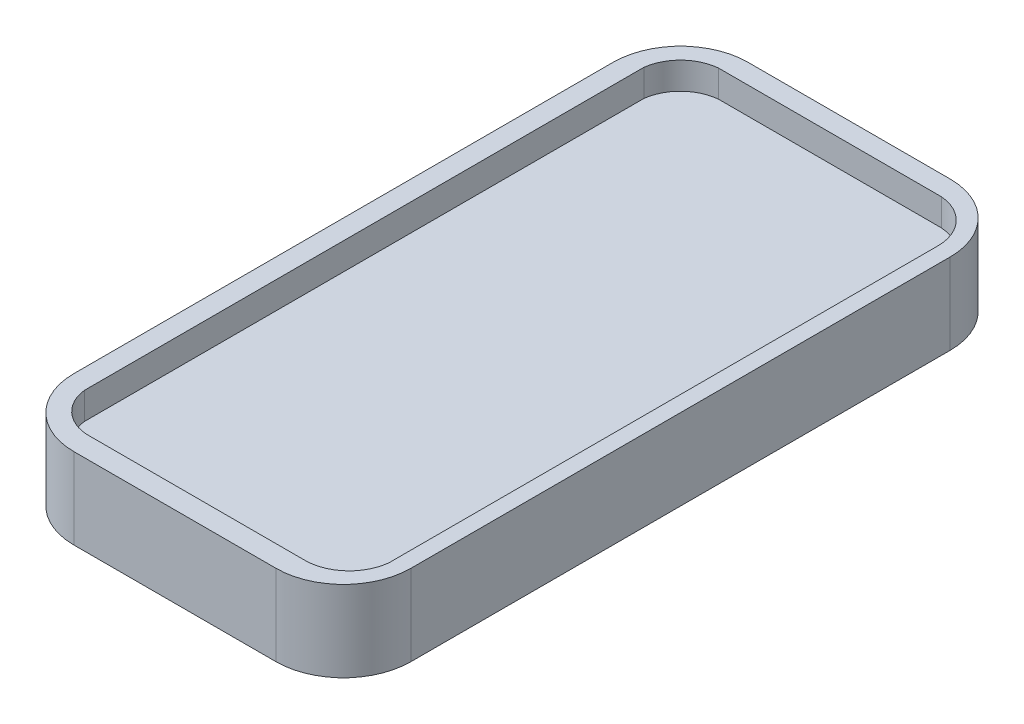
ISO-10303-21;
HEADER;
FILE_DESCRIPTION(('STEP AP214'),'2;1');
FILE_NAME('part.step','',(''),(''),'','','');
FILE_SCHEMA(('AUTOMOTIVE_DESIGN { 1 0 10303 214 1 1 1 1 }'));
ENDSEC;
DATA;
#1=APPLICATION_CONTEXT('core data for automotive mechanical design processes');
#2=APPLICATION_PROTOCOL_DEFINITION('international standard','automotive_design',2000,#1);
#3=PRODUCT_CONTEXT('',#1,'mechanical');
#4=PRODUCT('Part','Part','',(#3));
#5=PRODUCT_RELATED_PRODUCT_CATEGORY('part','',(#4));
#6=PRODUCT_DEFINITION_FORMATION('','',#4);
#7=PRODUCT_DEFINITION_CONTEXT('part definition',#1,'design');
#8=PRODUCT_DEFINITION('design','',#6,#7);
#9=PRODUCT_DEFINITION_SHAPE('','',#8);
#10=(LENGTH_UNIT() NAMED_UNIT(*) SI_UNIT(.MILLI.,.METRE.));
#11=(NAMED_UNIT(*) PLANE_ANGLE_UNIT() SI_UNIT($,.RADIAN.));
#12=(NAMED_UNIT(*) SI_UNIT($,.STERADIAN.) SOLID_ANGLE_UNIT());
#13=UNCERTAINTY_MEASURE_WITH_UNIT(LENGTH_MEASURE(1.E-05),#10,'distance_accuracy_value','');
#14=(GEOMETRIC_REPRESENTATION_CONTEXT(3) GLOBAL_UNCERTAINTY_ASSIGNED_CONTEXT((#13)) GLOBAL_UNIT_ASSIGNED_CONTEXT((#10,
#11,#12)) REPRESENTATION_CONTEXT('',''));
#15=CARTESIAN_POINT('',(0.,0.,0.));
#16=DIRECTION('',(0.,0.,1.));
#17=DIRECTION('',(1.,0.,0.));
#18=AXIS2_PLACEMENT_3D('',#15,#16,#17);
#19=CARTESIAN_POINT('',(-7.78045965694231,120.,-951.577872826817));
#20=DIRECTION('',(1.,0.,0.));
#21=DIRECTION('',(0.,0.,-1.));
#22=AXIS2_PLACEMENT_3D('',#19,#20,#21);
#23=PLANE('',#22);
#24=DIRECTION('',(0.,0.,1.));
#25=VECTOR('',#24,1.);
#26=CARTESIAN_POINT('',(-7.78045965694231,120.,-951.577872826817));
#27=LINE('',#26,#25);
#28=CARTESIAN_POINT('',(-7.78045965694229,120.,-851.577872826817));
#29=VERTEX_POINT('',#28);
#30=CARTESIAN_POINT('',(-7.7804596569422,120.,-51.5778728268174));
#31=VERTEX_POINT('',#30);
#32=EDGE_CURVE('E220',#29,#31,#27,.T.);
#33=ORIENTED_EDGE('',*,*,#32,.F.);
#34=DIRECTION('',(0.,-1.,0.));
#35=VECTOR('',#34,1.);
#36=CARTESIAN_POINT('',(-7.78045965694229,120.,-851.577872826817));
#37=LINE('',#36,#35);
#38=CARTESIAN_POINT('',(-7.78045965694229,0.,-851.577872826817));
#39=VERTEX_POINT('',#38);
#40=EDGE_CURVE('E243',#29,#39,#37,.T.);
#41=ORIENTED_EDGE('',*,*,#40,.T.);
#42=DIRECTION('',(0.,0.,1.));
#43=VECTOR('',#42,1.);
#44=CARTESIAN_POINT('',(-7.78045965694231,0.,-951.577872826817));
#45=LINE('',#44,#43);
#46=CARTESIAN_POINT('',(-7.7804596569422,0.,-51.5778728268174));
#47=VERTEX_POINT('',#46);
#48=EDGE_CURVE('E208',#39,#47,#45,.T.);
#49=ORIENTED_EDGE('',*,*,#48,.T.);
#50=DIRECTION('',(0.,-1.,0.));
#51=VECTOR('',#50,1.);
#52=CARTESIAN_POINT('',(-7.7804596569422,120.,-51.5778728268174));
#53=LINE('',#52,#51);
#54=EDGE_CURVE('E232',#47,#31,#53,.F.);
#55=ORIENTED_EDGE('',*,*,#54,.T.);
#56=EDGE_LOOP('',(#33,#41,#49,#55));
#57=FACE_BOUND('',#56,.T.);
#58=ADVANCED_FACE('F34',(#57),#23,.F.);
#59=CARTESIAN_POINT('',(-7.78045965694218,120.,48.4221271731826));
#60=DIRECTION('',(0.,0.,-1.));
#61=DIRECTION('',(-1.,0.,0.));
#62=AXIS2_PLACEMENT_3D('',#59,#60,#61);
#63=PLANE('',#62);
#64=DIRECTION('',(1.,0.,0.));
#65=VECTOR('',#64,1.);
#66=CARTESIAN_POINT('',(-7.78045965694218,120.,48.4221271731826));
#67=LINE('',#66,#65);
#68=CARTESIAN_POINT('',(92.2195403430578,120.,48.4221271731826));
#69=VERTEX_POINT('',#68);
#70=CARTESIAN_POINT('',(392.219540343058,120.,48.4221271731826));
#71=VERTEX_POINT('',#70);
#72=EDGE_CURVE('E223',#69,#71,#67,.T.);
#73=ORIENTED_EDGE('',*,*,#72,.F.);
#74=DIRECTION('',(0.,-1.,0.));
#75=VECTOR('',#74,1.);
#76=CARTESIAN_POINT('',(92.2195403430578,120.,48.4221271731826));
#77=LINE('',#76,#75);
#78=CARTESIAN_POINT('',(92.2195403430578,0.,48.4221271731826));
#79=VERTEX_POINT('',#78);
#80=EDGE_CURVE('E12',#69,#79,#77,.T.);
#81=ORIENTED_EDGE('',*,*,#80,.T.);
#82=DIRECTION('',(1.,0.,0.));
#83=VECTOR('',#82,1.);
#84=CARTESIAN_POINT('',(-7.78045965694218,0.,48.4221271731826));
#85=LINE('',#84,#83);
#86=CARTESIAN_POINT('',(392.219540343058,0.,48.4221271731826));
#87=VERTEX_POINT('',#86);
#88=EDGE_CURVE('E235',#79,#87,#85,.T.);
#89=ORIENTED_EDGE('',*,*,#88,.T.);
#90=DIRECTION('',(0.,-1.,0.));
#91=VECTOR('',#90,1.);
#92=CARTESIAN_POINT('',(392.219540343058,120.,48.4221271731826));
#93=LINE('',#92,#91);
#94=EDGE_CURVE('E42',#87,#71,#93,.F.);
#95=ORIENTED_EDGE('',*,*,#94,.T.);
#96=EDGE_LOOP('',(#73,#81,#89,#95));
#97=FACE_BOUND('',#96,.T.);
#98=ADVANCED_FACE('F273',(#97),#63,.F.);
#99=CARTESIAN_POINT('',(492.219540343058,120.,-951.577872826817));
#100=DIRECTION('',(-1.,0.,0.));
#101=DIRECTION('',(0.,0.,1.));
#102=AXIS2_PLACEMENT_3D('',#99,#100,#101);
#103=PLANE('',#102);
#104=DIRECTION('',(0.,0.,-1.));
#105=VECTOR('',#104,1.);
#106=CARTESIAN_POINT('',(492.219540343058,0.,-951.577872826817));
#107=LINE('',#106,#105);
#108=CARTESIAN_POINT('',(492.219540343058,0.,-51.5778728268174));
#109=VERTEX_POINT('',#108);
#110=CARTESIAN_POINT('',(492.219540343058,0.,-851.577872826817));
#111=VERTEX_POINT('',#110);
#112=EDGE_CURVE('E238',#109,#111,#107,.T.);
#113=ORIENTED_EDGE('',*,*,#112,.T.);
#114=DIRECTION('',(0.,-1.,0.));
#115=VECTOR('',#114,1.);
#116=CARTESIAN_POINT('',(492.219540343058,120.,-851.577872826817));
#117=LINE('',#116,#115);
#118=CARTESIAN_POINT('',(492.219540343058,120.,-851.577872826817));
#119=VERTEX_POINT('',#118);
#120=EDGE_CURVE('E57',#111,#119,#117,.F.);
#121=ORIENTED_EDGE('',*,*,#120,.T.);
#122=DIRECTION('',(0.,0.,-1.));
#123=VECTOR('',#122,1.);
#124=CARTESIAN_POINT('',(492.219540343058,120.,-951.577872826817));
#125=LINE('',#124,#123);
#126=CARTESIAN_POINT('',(492.219540343058,120.,-51.5778728268174));
#127=VERTEX_POINT('',#126);
#128=EDGE_CURVE('E227',#127,#119,#125,.T.);
#129=ORIENTED_EDGE('',*,*,#128,.F.);
#130=DIRECTION('',(0.,-1.,0.));
#131=VECTOR('',#130,1.);
#132=CARTESIAN_POINT('',(492.219540343058,120.,-51.5778728268174));
#133=LINE('',#132,#131);
#134=EDGE_CURVE('E267',#127,#109,#133,.T.);
#135=ORIENTED_EDGE('',*,*,#134,.T.);
#136=EDGE_LOOP('',(#113,#121,#129,#135));
#137=FACE_BOUND('',#136,.T.);
#138=ADVANCED_FACE('F283',(#137),#103,.F.);
#139=CARTESIAN_POINT('',(-7.78045965694231,120.,-951.577872826817));
#140=DIRECTION('',(0.,0.,1.));
#141=DIRECTION('',(1.,0.,0.));
#142=AXIS2_PLACEMENT_3D('',#139,#140,#141);
#143=PLANE('',#142);
#144=DIRECTION('',(-1.,0.,0.));
#145=VECTOR('',#144,1.);
#146=CARTESIAN_POINT('',(-7.78045965694231,0.,-951.577872826817));
#147=LINE('',#146,#145);
#148=CARTESIAN_POINT('',(392.219540343058,0.,-951.577872826817));
#149=VERTEX_POINT('',#148);
#150=CARTESIAN_POINT('',(92.2195403430577,0.,-951.577872826817));
#151=VERTEX_POINT('',#150);
#152=EDGE_CURVE('E224',#149,#151,#147,.T.);
#153=ORIENTED_EDGE('',*,*,#152,.T.);
#154=DIRECTION('',(0.,-1.,0.));
#155=VECTOR('',#154,1.);
#156=CARTESIAN_POINT('',(92.2195403430577,120.,-951.577872826817));
#157=LINE('',#156,#155);
#158=CARTESIAN_POINT('',(92.2195403430577,120.,-951.577872826817));
#159=VERTEX_POINT('',#158);
#160=EDGE_CURVE('E257',#151,#159,#157,.F.);
#161=ORIENTED_EDGE('',*,*,#160,.T.);
#162=DIRECTION('',(-1.,0.,0.));
#163=VECTOR('',#162,1.);
#164=CARTESIAN_POINT('',(-7.78045965694231,120.,-951.577872826817));
#165=LINE('',#164,#163);
#166=CARTESIAN_POINT('',(392.219540343058,120.,-951.577872826817));
#167=VERTEX_POINT('',#166);
#168=EDGE_CURVE('E229',#167,#159,#165,.T.);
#169=ORIENTED_EDGE('',*,*,#168,.F.);
#170=DIRECTION('',(0.,-1.,0.));
#171=VECTOR('',#170,1.);
#172=CARTESIAN_POINT('',(392.219540343058,120.,-951.577872826817));
#173=LINE('',#172,#171);
#174=EDGE_CURVE('E254',#167,#149,#173,.T.);
#175=ORIENTED_EDGE('',*,*,#174,.T.);
#176=EDGE_LOOP('',(#153,#161,#169,#175));
#177=FACE_BOUND('',#176,.T.);
#178=ADVANCED_FACE('F294',(#177),#143,.F.);
#179=CARTESIAN_POINT('',(0.,120.,0.));
#180=DIRECTION('',(0.,1.,0.));
#181=DIRECTION('',(0.,0.,1.));
#182=AXIS2_PLACEMENT_3D('',#179,#180,#181);
#183=PLANE('',#182);
#184=CARTESIAN_POINT('',(83.4549372179487,120.,-45.5551585176228));
#185=DIRECTION('',(0.,1.,0.));
#186=DIRECTION('',(0.,0.,1.));
#187=AXIS2_PLACEMENT_3D('',#184,#185,#186);
#188=CIRCLE('',#187,62.4222434877103);
#189=CARTESIAN_POINT('',(21.508862224403,120.,-37.8596874512748));
#190=VERTEX_POINT('',#189);
#191=CARTESIAN_POINT('',(79.5875440235673,120.,16.7471668957922));
#192=VERTEX_POINT('',#191);
#193=EDGE_CURVE('E49',#190,#192,#188,.T.);
#194=ORIENTED_EDGE('',*,*,#193,.F.);
#195=DIRECTION('',(0.,0.,1.));
#196=VECTOR('',#195,1.);
#197=CARTESIAN_POINT('',(21.508862224403,120.,-867.822814394367));
#198=LINE('',#197,#196);
#199=CARTESIAN_POINT('',(21.508862224403,120.,-867.822814394367));
#200=VERTEX_POINT('',#199);
#201=EDGE_CURVE('E170',#200,#190,#198,.T.);
#202=ORIENTED_EDGE('',*,*,#201,.F.);
#203=CARTESIAN_POINT('',(83.4549372179487,120.,-860.127343328019));
#204=DIRECTION('',(0.,1.,0.));
#205=DIRECTION('',(0.,0.,1.));
#206=AXIS2_PLACEMENT_3D('',#203,#204,#205);
#207=CIRCLE('',#206,62.4222434877104);
#208=CARTESIAN_POINT('',(77.752240524381,120.,-922.288550945472));
#209=VERTEX_POINT('',#208);
#210=EDGE_CURVE('E173',#209,#200,#207,.T.);
#211=ORIENTED_EDGE('',*,*,#210,.F.);
#212=DIRECTION('',(-1.,0.,0.));
#213=VECTOR('',#212,1.);
#214=CARTESIAN_POINT('',(77.752240524381,120.,-922.288550945472));
#215=LINE('',#214,#213);
#216=CARTESIAN_POINT('',(408.615788100703,120.,-922.288550945472));
#217=VERTEX_POINT('',#216);
#218=EDGE_CURVE('E201',#217,#209,#215,.T.);
#219=ORIENTED_EDGE('',*,*,#218,.F.);
#220=CARTESIAN_POINT('',(402.913091407135,120.,-856.568140193166));
#221=DIRECTION('',(0.,1.,0.));
#222=DIRECTION('',(0.,0.,1.));
#223=AXIS2_PLACEMENT_3D('',#220,#221,#222);
#224=CIRCLE('',#223,65.9673641964772);
#225=CARTESIAN_POINT('',(468.879013747041,120.,-857.00429254749));
#226=VERTEX_POINT('',#225);
#227=EDGE_CURVE('E198',#226,#217,#224,.T.);
#228=ORIENTED_EDGE('',*,*,#227,.F.);
#229=DIRECTION('',(0.,0.,-1.));
#230=VECTOR('',#229,1.);
#231=CARTESIAN_POINT('',(468.879013747041,120.,-857.00429254749));
#232=LINE('',#231,#230);
#233=CARTESIAN_POINT('',(468.879013747041,120.,-42.2181657520519));
#234=VERTEX_POINT('',#233);
#235=EDGE_CURVE('E195',#234,#226,#232,.T.);
#236=ORIENTED_EDGE('',*,*,#235,.F.);
#237=CARTESIAN_POINT('',(402.913091407135,120.,-49.5074973572647));
#238=DIRECTION('',(0.,1.,0.));
#239=DIRECTION('',(0.,0.,1.));
#240=AXIS2_PLACEMENT_3D('',#237,#238,#239);
#241=CIRCLE('',#240,66.3674413052458);
#242=CARTESIAN_POINT('',(406.780484601518,120.,16.7471668957921));
#243=VERTEX_POINT('',#242);
#244=EDGE_CURVE('E192',#243,#234,#241,.T.);
#245=ORIENTED_EDGE('',*,*,#244,.F.);
#246=DIRECTION('',(1.,0.,0.));
#247=VECTOR('',#246,1.);
#248=CARTESIAN_POINT('',(79.5875440235673,120.,16.7471668957922));
#249=LINE('',#248,#247);
#250=EDGE_CURVE('E190',#192,#243,#249,.T.);
#251=ORIENTED_EDGE('',*,*,#250,.F.);
#252=EDGE_LOOP('',(#194,#202,#211,#219,#228,#236,#245,#251));
#253=FACE_BOUND('',#252,.T.);
#254=ORIENTED_EDGE('',*,*,#168,.T.);
#255=CARTESIAN_POINT('',(92.2195403430577,120.,-851.577872826817));
#256=DIRECTION('',(0.,1.,0.));
#257=DIRECTION('',(0.,0.,1.));
#258=AXIS2_PLACEMENT_3D('',#255,#256,#257);
#259=CIRCLE('',#258,100.);
#260=EDGE_CURVE('E265',#159,#29,#259,.T.);
#261=ORIENTED_EDGE('',*,*,#260,.T.);
#262=ORIENTED_EDGE('',*,*,#32,.T.);
#263=CARTESIAN_POINT('',(92.2195403430578,120.,-51.5778728268174));
#264=DIRECTION('',(0.,1.,0.));
#265=DIRECTION('',(0.,0.,1.));
#266=AXIS2_PLACEMENT_3D('',#263,#264,#265);
#267=CIRCLE('',#266,100.);
#268=EDGE_CURVE('E261',#31,#69,#267,.T.);
#269=ORIENTED_EDGE('',*,*,#268,.T.);
#270=ORIENTED_EDGE('',*,*,#72,.T.);
#271=CARTESIAN_POINT('',(392.219540343058,120.,-51.5778728268174));
#272=DIRECTION('',(0.,1.,0.));
#273=DIRECTION('',(0.,0.,1.));
#274=AXIS2_PLACEMENT_3D('',#271,#272,#273);
#275=CIRCLE('',#274,100.);
#276=EDGE_CURVE('E259',#71,#127,#275,.T.);
#277=ORIENTED_EDGE('',*,*,#276,.T.);
#278=ORIENTED_EDGE('',*,*,#128,.T.);
#279=CARTESIAN_POINT('',(392.219540343058,120.,-851.577872826817));
#280=DIRECTION('',(0.,1.,0.));
#281=DIRECTION('',(0.,0.,1.));
#282=AXIS2_PLACEMENT_3D('',#279,#280,#281);
#283=CIRCLE('',#282,100.);
#284=EDGE_CURVE('E263',#119,#167,#283,.T.);
#285=ORIENTED_EDGE('',*,*,#284,.T.);
#286=EDGE_LOOP('',(#254,#261,#262,#269,#270,#277,#278,#285));
#287=FACE_BOUND('',#286,.T.);
#288=ADVANCED_FACE('F279',(#253,#287),#183,.T.);
#289=CARTESIAN_POINT('',(0.,0.,0.));
#290=DIRECTION('',(0.,1.,0.));
#291=DIRECTION('',(0.,0.,1.));
#292=AXIS2_PLACEMENT_3D('',#289,#290,#291);
#293=PLANE('',#292);
#294=ORIENTED_EDGE('',*,*,#48,.F.);
#295=CARTESIAN_POINT('',(92.2195403430577,0.,-851.577872826817));
#296=DIRECTION('',(0.,1.,0.));
#297=DIRECTION('',(0.,0.,1.));
#298=AXIS2_PLACEMENT_3D('',#295,#296,#297);
#299=CIRCLE('',#298,100.);
#300=EDGE_CURVE('E252',#39,#151,#299,.F.);
#301=ORIENTED_EDGE('',*,*,#300,.T.);
#302=ORIENTED_EDGE('',*,*,#152,.F.);
#303=CARTESIAN_POINT('',(392.219540343058,0.,-851.577872826817));
#304=DIRECTION('',(0.,1.,0.));
#305=DIRECTION('',(0.,0.,1.));
#306=AXIS2_PLACEMENT_3D('',#303,#304,#305);
#307=CIRCLE('',#306,100.);
#308=EDGE_CURVE('E250',#149,#111,#307,.F.);
#309=ORIENTED_EDGE('',*,*,#308,.T.);
#310=ORIENTED_EDGE('',*,*,#112,.F.);
#311=CARTESIAN_POINT('',(392.219540343058,0.,-51.5778728268174));
#312=DIRECTION('',(0.,1.,0.));
#313=DIRECTION('',(0.,0.,1.));
#314=AXIS2_PLACEMENT_3D('',#311,#312,#313);
#315=CIRCLE('',#314,100.);
#316=EDGE_CURVE('E246',#109,#87,#315,.F.);
#317=ORIENTED_EDGE('',*,*,#316,.T.);
#318=ORIENTED_EDGE('',*,*,#88,.F.);
#319=CARTESIAN_POINT('',(92.2195403430578,0.,-51.5778728268174));
#320=DIRECTION('',(0.,1.,0.));
#321=DIRECTION('',(0.,0.,1.));
#322=AXIS2_PLACEMENT_3D('',#319,#320,#321);
#323=CIRCLE('',#322,100.);
#324=EDGE_CURVE('E248',#79,#47,#323,.F.);
#325=ORIENTED_EDGE('',*,*,#324,.T.);
#326=EDGE_LOOP('',(#294,#301,#302,#309,#310,#317,#318,#325));
#327=FACE_BOUND('',#326,.T.);
#328=ADVANCED_FACE('F286',(#327),#293,.F.);
#329=CARTESIAN_POINT('',(92.2195403430577,120.,-851.577872826817));
#330=DIRECTION('',(0.,-1.,0.));
#331=DIRECTION('',(0.,0.,-1.));
#332=AXIS2_PLACEMENT_3D('',#329,#330,#331);
#333=CYLINDRICAL_SURFACE('',#332,100.);
#334=ORIENTED_EDGE('',*,*,#260,.F.);
#335=ORIENTED_EDGE('',*,*,#160,.F.);
#336=ORIENTED_EDGE('',*,*,#300,.F.);
#337=ORIENTED_EDGE('',*,*,#40,.F.);
#338=EDGE_LOOP('',(#334,#335,#336,#337));
#339=FACE_BOUND('',#338,.T.);
#340=ADVANCED_FACE('F300',(#339),#333,.T.);
#341=CARTESIAN_POINT('',(392.219540343058,120.,-851.577872826817));
#342=DIRECTION('',(0.,-1.,0.));
#343=DIRECTION('',(0.,0.,-1.));
#344=AXIS2_PLACEMENT_3D('',#341,#342,#343);
#345=CYLINDRICAL_SURFACE('',#344,100.);
#346=ORIENTED_EDGE('',*,*,#284,.F.);
#347=ORIENTED_EDGE('',*,*,#120,.F.);
#348=ORIENTED_EDGE('',*,*,#308,.F.);
#349=ORIENTED_EDGE('',*,*,#174,.F.);
#350=EDGE_LOOP('',(#346,#347,#348,#349));
#351=FACE_BOUND('',#350,.T.);
#352=ADVANCED_FACE('F291',(#351),#345,.T.);
#353=CARTESIAN_POINT('',(92.2195403430578,120.,-51.5778728268174));
#354=DIRECTION('',(0.,-1.,0.));
#355=DIRECTION('',(0.,0.,-1.));
#356=AXIS2_PLACEMENT_3D('',#353,#354,#355);
#357=CYLINDRICAL_SURFACE('',#356,100.);
#358=ORIENTED_EDGE('',*,*,#268,.F.);
#359=ORIENTED_EDGE('',*,*,#54,.F.);
#360=ORIENTED_EDGE('',*,*,#324,.F.);
#361=ORIENTED_EDGE('',*,*,#80,.F.);
#362=EDGE_LOOP('',(#358,#359,#360,#361));
#363=FACE_BOUND('',#362,.T.);
#364=ADVANCED_FACE('F304',(#363),#357,.T.);
#365=CARTESIAN_POINT('',(392.219540343058,120.,-51.5778728268174));
#366=DIRECTION('',(0.,-1.,0.));
#367=DIRECTION('',(0.,0.,-1.));
#368=AXIS2_PLACEMENT_3D('',#365,#366,#367);
#369=CYLINDRICAL_SURFACE('',#368,100.);
#370=ORIENTED_EDGE('',*,*,#276,.F.);
#371=ORIENTED_EDGE('',*,*,#94,.F.);
#372=ORIENTED_EDGE('',*,*,#316,.F.);
#373=ORIENTED_EDGE('',*,*,#134,.F.);
#374=EDGE_LOOP('',(#370,#371,#372,#373));
#375=FACE_BOUND('',#374,.T.);
#376=ADVANCED_FACE('F36',(#375),#369,.T.);
#377=CARTESIAN_POINT('',(83.4549372179487,80.,-45.5551585176228));
#378=DIRECTION('',(0.,1.,0.));
#379=DIRECTION('',(0.,0.,1.));
#380=AXIS2_PLACEMENT_3D('',#377,#378,#379);
#381=CYLINDRICAL_SURFACE('',#380,62.4222434877103);
#382=ORIENTED_EDGE('',*,*,#193,.T.);
#383=DIRECTION('',(0.,1.,0.));
#384=VECTOR('',#383,1.);
#385=CARTESIAN_POINT('',(79.5875440235673,80.,16.7471668957922));
#386=LINE('',#385,#384);
#387=CARTESIAN_POINT('',(79.5875440235673,80.,16.7471668957922));
#388=VERTEX_POINT('',#387);
#389=EDGE_CURVE('E147',#388,#192,#386,.T.);
#390=ORIENTED_EDGE('',*,*,#389,.F.);
#391=CARTESIAN_POINT('',(83.4549372179487,80.,-45.5551585176228));
#392=DIRECTION('',(0.,1.,0.));
#393=DIRECTION('',(0.,0.,1.));
#394=AXIS2_PLACEMENT_3D('',#391,#392,#393);
#395=CIRCLE('',#394,62.4222434877103);
#396=CARTESIAN_POINT('',(21.508862224403,80.,-37.8596874512748));
#397=VERTEX_POINT('',#396);
#398=EDGE_CURVE('E151',#397,#388,#395,.T.);
#399=ORIENTED_EDGE('',*,*,#398,.F.);
#400=DIRECTION('',(0.,1.,0.));
#401=VECTOR('',#400,1.);
#402=CARTESIAN_POINT('',(21.508862224403,80.,-37.8596874512748));
#403=LINE('',#402,#401);
#404=EDGE_CURVE('E206',#397,#190,#403,.T.);
#405=ORIENTED_EDGE('',*,*,#404,.T.);
#406=EDGE_LOOP('',(#382,#390,#399,#405));
#407=FACE_BOUND('',#406,.T.);
#408=ADVANCED_FACE('F149',(#407),#381,.F.);
#409=CARTESIAN_POINT('',(21.508862224403,80.,-867.822814394367));
#410=DIRECTION('',(-1.,0.,0.));
#411=DIRECTION('',(0.,0.,1.));
#412=AXIS2_PLACEMENT_3D('',#409,#410,#411);
#413=PLANE('',#412);
#414=ORIENTED_EDGE('',*,*,#201,.T.);
#415=ORIENTED_EDGE('',*,*,#404,.F.);
#416=DIRECTION('',(0.,0.,1.));
#417=VECTOR('',#416,1.);
#418=CARTESIAN_POINT('',(21.508862224403,80.,-867.822814394367));
#419=LINE('',#418,#417);
#420=CARTESIAN_POINT('',(21.508862224403,80.,-867.822814394367));
#421=VERTEX_POINT('',#420);
#422=EDGE_CURVE('E157',#421,#397,#419,.T.);
#423=ORIENTED_EDGE('',*,*,#422,.F.);
#424=DIRECTION('',(0.,1.,0.));
#425=VECTOR('',#424,1.);
#426=CARTESIAN_POINT('',(21.508862224403,80.,-867.822814394367));
#427=LINE('',#426,#425);
#428=EDGE_CURVE('E209',#421,#200,#427,.T.);
#429=ORIENTED_EDGE('',*,*,#428,.T.);
#430=EDGE_LOOP('',(#414,#415,#423,#429));
#431=FACE_BOUND('',#430,.T.);
#432=ADVANCED_FACE('F358',(#431),#413,.F.);
#433=CARTESIAN_POINT('',(83.4549372179487,80.,-860.127343328019));
#434=DIRECTION('',(0.,1.,0.));
#435=DIRECTION('',(0.,0.,1.));
#436=AXIS2_PLACEMENT_3D('',#433,#434,#435);
#437=CYLINDRICAL_SURFACE('',#436,62.4222434877104);
#438=ORIENTED_EDGE('',*,*,#210,.T.);
#439=ORIENTED_EDGE('',*,*,#428,.F.);
#440=CARTESIAN_POINT('',(83.4549372179487,80.,-860.127343328019));
#441=DIRECTION('',(0.,1.,0.));
#442=DIRECTION('',(0.,0.,1.));
#443=AXIS2_PLACEMENT_3D('',#440,#441,#442);
#444=CIRCLE('',#443,62.4222434877104);
#445=CARTESIAN_POINT('',(77.752240524381,80.,-922.288550945472));
#446=VERTEX_POINT('',#445);
#447=EDGE_CURVE('E186',#446,#421,#444,.T.);
#448=ORIENTED_EDGE('',*,*,#447,.F.);
#449=DIRECTION('',(0.,1.,0.));
#450=VECTOR('',#449,1.);
#451=CARTESIAN_POINT('',(77.752240524381,80.,-922.288550945472));
#452=LINE('',#451,#450);
#453=EDGE_CURVE('E211',#446,#209,#452,.T.);
#454=ORIENTED_EDGE('',*,*,#453,.T.);
#455=EDGE_LOOP('',(#438,#439,#448,#454));
#456=FACE_BOUND('',#455,.T.);
#457=ADVANCED_FACE('F366',(#456),#437,.F.);
#458=CARTESIAN_POINT('',(77.752240524381,80.,-922.288550945472));
#459=DIRECTION('',(0.,0.,-1.));
#460=DIRECTION('',(-1.,0.,0.));
#461=AXIS2_PLACEMENT_3D('',#458,#459,#460);
#462=PLANE('',#461);
#463=ORIENTED_EDGE('',*,*,#218,.T.);
#464=ORIENTED_EDGE('',*,*,#453,.F.);
#465=DIRECTION('',(-1.,0.,0.));
#466=VECTOR('',#465,1.);
#467=CARTESIAN_POINT('',(77.752240524381,80.,-922.288550945472));
#468=LINE('',#467,#466);
#469=CARTESIAN_POINT('',(408.615788100703,80.,-922.288550945472));
#470=VERTEX_POINT('',#469);
#471=EDGE_CURVE('E183',#470,#446,#468,.T.);
#472=ORIENTED_EDGE('',*,*,#471,.F.);
#473=DIRECTION('',(0.,1.,0.));
#474=VECTOR('',#473,1.);
#475=CARTESIAN_POINT('',(408.615788100703,80.,-922.288550945472));
#476=LINE('',#475,#474);
#477=EDGE_CURVE('E213',#470,#217,#476,.T.);
#478=ORIENTED_EDGE('',*,*,#477,.T.);
#479=EDGE_LOOP('',(#463,#464,#472,#478));
#480=FACE_BOUND('',#479,.T.);
#481=ADVANCED_FACE('F376',(#480),#462,.F.);
#482=CARTESIAN_POINT('',(402.913091407135,80.,-856.568140193166));
#483=DIRECTION('',(0.,1.,0.));
#484=DIRECTION('',(0.,0.,1.));
#485=AXIS2_PLACEMENT_3D('',#482,#483,#484);
#486=CYLINDRICAL_SURFACE('',#485,65.9673641964772);
#487=ORIENTED_EDGE('',*,*,#227,.T.);
#488=ORIENTED_EDGE('',*,*,#477,.F.);
#489=CARTESIAN_POINT('',(402.913091407135,80.,-856.568140193166));
#490=DIRECTION('',(0.,1.,0.));
#491=DIRECTION('',(0.,0.,1.));
#492=AXIS2_PLACEMENT_3D('',#489,#490,#491);
#493=CIRCLE('',#492,65.9673641964772);
#494=CARTESIAN_POINT('',(468.879013747041,80.,-857.00429254749));
#495=VERTEX_POINT('',#494);
#496=EDGE_CURVE('E180',#495,#470,#493,.T.);
#497=ORIENTED_EDGE('',*,*,#496,.F.);
#498=DIRECTION('',(0.,1.,0.));
#499=VECTOR('',#498,1.);
#500=CARTESIAN_POINT('',(468.879013747041,80.,-857.00429254749));
#501=LINE('',#500,#499);
#502=EDGE_CURVE('E215',#495,#226,#501,.T.);
#503=ORIENTED_EDGE('',*,*,#502,.T.);
#504=EDGE_LOOP('',(#487,#488,#497,#503));
#505=FACE_BOUND('',#504,.T.);
#506=ADVANCED_FACE('F386',(#505),#486,.F.);
#507=CARTESIAN_POINT('',(468.879013747041,80.,-857.00429254749));
#508=DIRECTION('',(1.,0.,0.));
#509=DIRECTION('',(0.,0.,-1.));
#510=AXIS2_PLACEMENT_3D('',#507,#508,#509);
#511=PLANE('',#510);
#512=ORIENTED_EDGE('',*,*,#235,.T.);
#513=ORIENTED_EDGE('',*,*,#502,.F.);
#514=DIRECTION('',(0.,0.,-1.));
#515=VECTOR('',#514,1.);
#516=CARTESIAN_POINT('',(468.879013747041,80.,-857.00429254749));
#517=LINE('',#516,#515);
#518=CARTESIAN_POINT('',(468.879013747041,80.,-42.2181657520519));
#519=VERTEX_POINT('',#518);
#520=EDGE_CURVE('E177',#519,#495,#517,.T.);
#521=ORIENTED_EDGE('',*,*,#520,.F.);
#522=DIRECTION('',(0.,1.,0.));
#523=VECTOR('',#522,1.);
#524=CARTESIAN_POINT('',(468.879013747041,80.,-42.2181657520519));
#525=LINE('',#524,#523);
#526=EDGE_CURVE('E217',#519,#234,#525,.T.);
#527=ORIENTED_EDGE('',*,*,#526,.T.);
#528=EDGE_LOOP('',(#512,#513,#521,#527));
#529=FACE_BOUND('',#528,.T.);
#530=ADVANCED_FACE('F396',(#529),#511,.F.);
#531=CARTESIAN_POINT('',(402.913091407135,80.,-49.5074973572647));
#532=DIRECTION('',(0.,1.,0.));
#533=DIRECTION('',(0.,0.,1.));
#534=AXIS2_PLACEMENT_3D('',#531,#532,#533);
#535=CYLINDRICAL_SURFACE('',#534,66.3674413052458);
#536=ORIENTED_EDGE('',*,*,#244,.T.);
#537=ORIENTED_EDGE('',*,*,#526,.F.);
#538=CARTESIAN_POINT('',(402.913091407135,80.,-49.5074973572647));
#539=DIRECTION('',(0.,1.,0.));
#540=DIRECTION('',(0.,0.,1.));
#541=AXIS2_PLACEMENT_3D('',#538,#539,#540);
#542=CIRCLE('',#541,66.3674413052458);
#543=CARTESIAN_POINT('',(406.780484601518,80.,16.7471668957921));
#544=VERTEX_POINT('',#543);
#545=EDGE_CURVE('E165',#544,#519,#542,.T.);
#546=ORIENTED_EDGE('',*,*,#545,.F.);
#547=DIRECTION('',(0.,1.,0.));
#548=VECTOR('',#547,1.);
#549=CARTESIAN_POINT('',(406.780484601518,80.,16.7471668957921));
#550=LINE('',#549,#548);
#551=EDGE_CURVE('E156',#544,#243,#550,.T.);
#552=ORIENTED_EDGE('',*,*,#551,.T.);
#553=EDGE_LOOP('',(#536,#537,#546,#552));
#554=FACE_BOUND('',#553,.T.);
#555=ADVANCED_FACE('F406',(#554),#535,.F.);
#556=CARTESIAN_POINT('',(79.5875440235673,80.,16.7471668957922));
#557=DIRECTION('',(0.,0.,1.));
#558=DIRECTION('',(1.,0.,0.));
#559=AXIS2_PLACEMENT_3D('',#556,#557,#558);
#560=PLANE('',#559);
#561=ORIENTED_EDGE('',*,*,#250,.T.);
#562=ORIENTED_EDGE('',*,*,#551,.F.);
#563=DIRECTION('',(1.,0.,0.));
#564=VECTOR('',#563,1.);
#565=CARTESIAN_POINT('',(79.5875440235673,80.,16.7471668957922));
#566=LINE('',#565,#564);
#567=EDGE_CURVE('E160',#388,#544,#566,.T.);
#568=ORIENTED_EDGE('',*,*,#567,.F.);
#569=ORIENTED_EDGE('',*,*,#389,.T.);
#570=EDGE_LOOP('',(#561,#562,#568,#569));
#571=FACE_BOUND('',#570,.T.);
#572=ADVANCED_FACE('F161',(#571),#560,.F.);
#573=CARTESIAN_POINT('',(83.4549372179487,80.,-45.5551585176228));
#574=DIRECTION('',(0.,1.,0.));
#575=DIRECTION('',(0.,0.,1.));
#576=AXIS2_PLACEMENT_3D('',#573,#574,#575);
#577=PLANE('',#576);
#578=ORIENTED_EDGE('',*,*,#398,.T.);
#579=ORIENTED_EDGE('',*,*,#567,.T.);
#580=ORIENTED_EDGE('',*,*,#545,.T.);
#581=ORIENTED_EDGE('',*,*,#520,.T.);
#582=ORIENTED_EDGE('',*,*,#496,.T.);
#583=ORIENTED_EDGE('',*,*,#471,.T.);
#584=ORIENTED_EDGE('',*,*,#447,.T.);
#585=ORIENTED_EDGE('',*,*,#422,.T.);
#586=EDGE_LOOP('',(#578,#579,#580,#581,#582,#583,#584,#585));
#587=FACE_BOUND('',#586,.T.);
#588=ADVANCED_FACE('F167',(#587),#577,.T.);
#589=CLOSED_SHELL('',(#58,#98,#138,#178,#288,#328,#340,#352,#364,#376,#408,#432,#457,#481,#506,
#530,#555,#572,#588));
#590=MANIFOLD_SOLID_BREP('B2',#589);
#591=ADVANCED_BREP_SHAPE_REPRESENTATION('',(#18,#590),#14);
#592=SHAPE_DEFINITION_REPRESENTATION(#9,#591);
ENDSEC;
END-ISO-10303-21;
